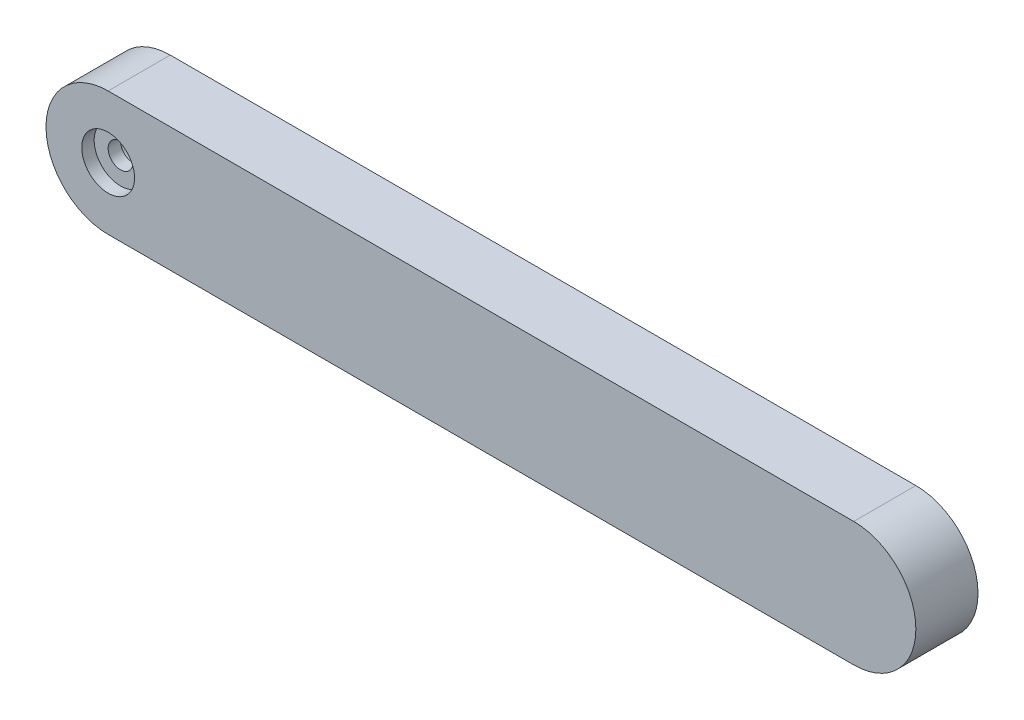
ISO-10303-21;
HEADER;
FILE_DESCRIPTION(('STEP AP214'),'2;1');
FILE_NAME('part.step','',(''),(''),'','','');
FILE_SCHEMA(('AUTOMOTIVE_DESIGN { 1 0 10303 214 1 1 1 1 }'));
ENDSEC;
DATA;
#1=APPLICATION_CONTEXT('core data for automotive mechanical design processes');
#2=APPLICATION_PROTOCOL_DEFINITION('international standard','automotive_design',2000,#1);
#3=PRODUCT_CONTEXT('',#1,'mechanical');
#4=PRODUCT('Part','Part','',(#3));
#5=PRODUCT_RELATED_PRODUCT_CATEGORY('part','',(#4));
#6=PRODUCT_DEFINITION_FORMATION('','',#4);
#7=PRODUCT_DEFINITION_CONTEXT('part definition',#1,'design');
#8=PRODUCT_DEFINITION('design','',#6,#7);
#9=PRODUCT_DEFINITION_SHAPE('','',#8);
#10=(LENGTH_UNIT() NAMED_UNIT(*) SI_UNIT(.MILLI.,.METRE.));
#11=(NAMED_UNIT(*) PLANE_ANGLE_UNIT() SI_UNIT($,.RADIAN.));
#12=(NAMED_UNIT(*) SI_UNIT($,.STERADIAN.) SOLID_ANGLE_UNIT());
#13=UNCERTAINTY_MEASURE_WITH_UNIT(LENGTH_MEASURE(1.E-05),#10,'distance_accuracy_value','');
#14=(GEOMETRIC_REPRESENTATION_CONTEXT(3) GLOBAL_UNCERTAINTY_ASSIGNED_CONTEXT((#13)) GLOBAL_UNIT_ASSIGNED_CONTEXT((#10,
#11,#12)) REPRESENTATION_CONTEXT('',''));
#15=CARTESIAN_POINT('',(0.,0.,0.));
#16=DIRECTION('',(0.,0.,1.));
#17=DIRECTION('',(1.,0.,0.));
#18=AXIS2_PLACEMENT_3D('',#15,#16,#17);
#19=CARTESIAN_POINT('',(0.,0.,5.));
#20=DIRECTION('',(0.,0.,-1.));
#21=DIRECTION('',(-1.,0.,0.));
#22=AXIS2_PLACEMENT_3D('',#19,#20,#21);
#23=CYLINDRICAL_SURFACE('',#22,5.);
#24=CARTESIAN_POINT('',(0.,0.,0.));
#25=DIRECTION('',(0.,0.,1.));
#26=DIRECTION('',(1.,0.,0.));
#27=AXIS2_PLACEMENT_3D('',#24,#25,#26);
#28=CIRCLE('',#27,5.);
#29=CARTESIAN_POINT('',(0.,5.,0.));
#30=VERTEX_POINT('',#29);
#31=CARTESIAN_POINT('',(0.,-5.,0.));
#32=VERTEX_POINT('',#31);
#33=EDGE_CURVE('E109',#30,#32,#28,.T.);
#34=ORIENTED_EDGE('',*,*,#33,.T.);
#35=DIRECTION('',(0.,0.,-1.));
#36=VECTOR('',#35,1.);
#37=CARTESIAN_POINT('',(0.,-5.,5.));
#38=LINE('',#37,#36);
#39=CARTESIAN_POINT('',(0.,-5.,5.));
#40=VERTEX_POINT('',#39);
#41=EDGE_CURVE('E11',#40,#32,#38,.T.);
#42=ORIENTED_EDGE('',*,*,#41,.F.);
#43=CARTESIAN_POINT('',(0.,0.,5.));
#44=DIRECTION('',(0.,0.,1.));
#45=DIRECTION('',(1.,0.,0.));
#46=AXIS2_PLACEMENT_3D('',#43,#44,#45);
#47=CIRCLE('',#46,5.);
#48=CARTESIAN_POINT('',(0.,5.,5.));
#49=VERTEX_POINT('',#48);
#50=EDGE_CURVE('E90',#49,#40,#47,.T.);
#51=ORIENTED_EDGE('',*,*,#50,.F.);
#52=DIRECTION('',(0.,0.,-1.));
#53=VECTOR('',#52,1.);
#54=CARTESIAN_POINT('',(0.,5.,5.));
#55=LINE('',#54,#53);
#56=EDGE_CURVE('E57',#49,#30,#55,.T.);
#57=ORIENTED_EDGE('',*,*,#56,.T.);
#58=EDGE_LOOP('',(#34,#42,#51,#57));
#59=FACE_BOUND('',#58,.T.);
#60=ADVANCED_FACE('F39',(#59),#23,.T.);
#61=CARTESIAN_POINT('',(0.,-5.,5.));
#62=DIRECTION('',(0.,1.,0.));
#63=DIRECTION('',(0.,0.,1.));
#64=AXIS2_PLACEMENT_3D('',#61,#62,#63);
#65=PLANE('',#64);
#66=DIRECTION('',(1.,0.,0.));
#67=VECTOR('',#66,1.);
#68=CARTESIAN_POINT('',(0.,-5.,0.));
#69=LINE('',#68,#67);
#70=CARTESIAN_POINT('',(60.,-5.,0.));
#71=VERTEX_POINT('',#70);
#72=EDGE_CURVE('E96',#32,#71,#69,.T.);
#73=ORIENTED_EDGE('',*,*,#72,.T.);
#74=DIRECTION('',(0.,0.,-1.));
#75=VECTOR('',#74,1.);
#76=CARTESIAN_POINT('',(60.,-5.,5.));
#77=LINE('',#76,#75);
#78=CARTESIAN_POINT('',(60.,-5.,5.));
#79=VERTEX_POINT('',#78);
#80=EDGE_CURVE('E49',#79,#71,#77,.T.);
#81=ORIENTED_EDGE('',*,*,#80,.F.);
#82=DIRECTION('',(1.,0.,0.));
#83=VECTOR('',#82,1.);
#84=CARTESIAN_POINT('',(0.,-5.,5.));
#85=LINE('',#84,#83);
#86=EDGE_CURVE('E83',#40,#79,#85,.T.);
#87=ORIENTED_EDGE('',*,*,#86,.F.);
#88=ORIENTED_EDGE('',*,*,#41,.T.);
#89=EDGE_LOOP('',(#73,#81,#87,#88));
#90=FACE_BOUND('',#89,.T.);
#91=ADVANCED_FACE('F95',(#90),#65,.F.);
#92=CARTESIAN_POINT('',(60.,0.,5.));
#93=DIRECTION('',(0.,0.,-1.));
#94=DIRECTION('',(-1.,0.,0.));
#95=AXIS2_PLACEMENT_3D('',#92,#93,#94);
#96=CYLINDRICAL_SURFACE('',#95,5.);
#97=CARTESIAN_POINT('',(60.,0.,0.));
#98=DIRECTION('',(0.,0.,1.));
#99=DIRECTION('',(1.,0.,0.));
#100=AXIS2_PLACEMENT_3D('',#97,#98,#99);
#101=CIRCLE('',#100,5.);
#102=CARTESIAN_POINT('',(60.,5.,0.));
#103=VERTEX_POINT('',#102);
#104=EDGE_CURVE('E115',#71,#103,#101,.T.);
#105=ORIENTED_EDGE('',*,*,#104,.T.);
#106=DIRECTION('',(0.,0.,-1.));
#107=VECTOR('',#106,1.);
#108=CARTESIAN_POINT('',(60.,5.,5.));
#109=LINE('',#108,#107);
#110=CARTESIAN_POINT('',(60.,5.,5.));
#111=VERTEX_POINT('',#110);
#112=EDGE_CURVE('E72',#111,#103,#109,.T.);
#113=ORIENTED_EDGE('',*,*,#112,.F.);
#114=CARTESIAN_POINT('',(60.,0.,5.));
#115=DIRECTION('',(0.,0.,1.));
#116=DIRECTION('',(1.,0.,0.));
#117=AXIS2_PLACEMENT_3D('',#114,#115,#116);
#118=CIRCLE('',#117,5.);
#119=EDGE_CURVE('E89',#79,#111,#118,.T.);
#120=ORIENTED_EDGE('',*,*,#119,.F.);
#121=ORIENTED_EDGE('',*,*,#80,.T.);
#122=EDGE_LOOP('',(#105,#113,#120,#121));
#123=FACE_BOUND('',#122,.T.);
#124=ADVANCED_FACE('F101',(#123),#96,.T.);
#125=CARTESIAN_POINT('',(0.,5.,5.));
#126=DIRECTION('',(0.,1.,0.));
#127=DIRECTION('',(0.,0.,1.));
#128=AXIS2_PLACEMENT_3D('',#125,#126,#127);
#129=PLANE('',#128);
#130=DIRECTION('',(1.,0.,0.));
#131=VECTOR('',#130,1.);
#132=CARTESIAN_POINT('',(0.,5.,0.));
#133=LINE('',#132,#131);
#134=EDGE_CURVE('E118',#30,#103,#133,.T.);
#135=ORIENTED_EDGE('',*,*,#134,.F.);
#136=ORIENTED_EDGE('',*,*,#56,.F.);
#137=DIRECTION('',(1.,0.,0.));
#138=VECTOR('',#137,1.);
#139=CARTESIAN_POINT('',(0.,5.,5.));
#140=LINE('',#139,#138);
#141=EDGE_CURVE('E103',#49,#111,#140,.T.);
#142=ORIENTED_EDGE('',*,*,#141,.T.);
#143=ORIENTED_EDGE('',*,*,#112,.T.);
#144=EDGE_LOOP('',(#135,#136,#142,#143));
#145=FACE_BOUND('',#144,.T.);
#146=ADVANCED_FACE('F170',(#145),#129,.T.);
#147=CARTESIAN_POINT('',(0.,0.,5.));
#148=DIRECTION('',(0.,0.,1.));
#149=DIRECTION('',(1.,0.,0.));
#150=AXIS2_PLACEMENT_3D('',#147,#148,#149);
#151=PLANE('',#150);
#152=CARTESIAN_POINT('',(0.,0.,5.));
#153=DIRECTION('',(0.,0.,1.));
#154=DIRECTION('',(1.,0.,0.));
#155=AXIS2_PLACEMENT_3D('',#152,#153,#154);
#156=CIRCLE('',#155,2.125);
#157=CARTESIAN_POINT('',(2.125,0.,5.));
#158=VERTEX_POINT('',#157);
#159=EDGE_CURVE('E136',#158,#158,#156,.T.);
#160=ORIENTED_EDGE('',*,*,#159,.F.);
#161=EDGE_LOOP('',(#160));
#162=FACE_BOUND('',#161,.T.);
#163=ORIENTED_EDGE('',*,*,#50,.T.);
#164=ORIENTED_EDGE('',*,*,#86,.T.);
#165=ORIENTED_EDGE('',*,*,#119,.T.);
#166=ORIENTED_EDGE('',*,*,#141,.F.);
#167=EDGE_LOOP('',(#163,#164,#165,#166));
#168=FACE_BOUND('',#167,.T.);
#169=ADVANCED_FACE('F86',(#162,#168),#151,.T.);
#170=CARTESIAN_POINT('',(0.,0.,0.));
#171=DIRECTION('',(0.,0.,1.));
#172=DIRECTION('',(1.,0.,0.));
#173=AXIS2_PLACEMENT_3D('',#170,#171,#172);
#174=PLANE('',#173);
#175=CARTESIAN_POINT('',(0.,0.,0.));
#176=DIRECTION('',(0.,0.,-1.));
#177=DIRECTION('',(-1.,0.,0.));
#178=AXIS2_PLACEMENT_3D('',#175,#176,#177);
#179=CIRCLE('',#178,2.0125);
#180=CARTESIAN_POINT('',(-2.0125,0.,0.));
#181=VERTEX_POINT('',#180);
#182=EDGE_CURVE('E128',#181,#181,#179,.T.);
#183=ORIENTED_EDGE('',*,*,#182,.F.);
#184=EDGE_LOOP('',(#183));
#185=FACE_BOUND('',#184,.T.);
#186=ORIENTED_EDGE('',*,*,#33,.F.);
#187=ORIENTED_EDGE('',*,*,#134,.T.);
#188=ORIENTED_EDGE('',*,*,#104,.F.);
#189=ORIENTED_EDGE('',*,*,#72,.F.);
#190=EDGE_LOOP('',(#186,#187,#188,#189));
#191=FACE_BOUND('',#190,.T.);
#192=ADVANCED_FACE('F164',(#185,#191),#174,.F.);
#193=CARTESIAN_POINT('',(0.,0.,3.));
#194=DIRECTION('',(0.,0.,-1.));
#195=DIRECTION('',(-1.,0.,0.));
#196=AXIS2_PLACEMENT_3D('',#193,#194,#195);
#197=CYLINDRICAL_SURFACE('',#196,2.0125);
#198=CARTESIAN_POINT('',(0.,0.,3.));
#199=DIRECTION('',(0.,0.,-1.));
#200=DIRECTION('',(-1.,0.,0.));
#201=AXIS2_PLACEMENT_3D('',#198,#199,#200);
#202=CIRCLE('',#201,2.0125);
#203=CARTESIAN_POINT('',(-2.0125,0.,3.));
#204=VERTEX_POINT('',#203);
#205=EDGE_CURVE('E112',#204,#204,#202,.T.);
#206=ORIENTED_EDGE('',*,*,#205,.F.);
#207=EDGE_LOOP('',(#206));
#208=FACE_BOUND('',#207,.T.);
#209=ORIENTED_EDGE('',*,*,#182,.T.);
#210=EDGE_LOOP('',(#209));
#211=FACE_BOUND('',#210,.T.);
#212=ADVANCED_FACE('F158',(#208,#211),#197,.F.);
#213=CARTESIAN_POINT('',(0.,0.,3.));
#214=DIRECTION('',(0.,0.,-1.));
#215=DIRECTION('',(-1.,0.,0.));
#216=AXIS2_PLACEMENT_3D('',#213,#214,#215);
#217=PLANE('',#216);
#218=CARTESIAN_POINT('',(0.,0.,3.));
#219=DIRECTION('',(0.,0.,-1.));
#220=DIRECTION('',(-1.,0.,0.));
#221=AXIS2_PLACEMENT_3D('',#218,#219,#220);
#222=CIRCLE('',#221,1.);
#223=CARTESIAN_POINT('',(-1.,0.,3.));
#224=VERTEX_POINT('',#223);
#225=EDGE_CURVE('E42',#224,#224,#222,.T.);
#226=ORIENTED_EDGE('',*,*,#225,.F.);
#227=EDGE_LOOP('',(#226));
#228=FACE_BOUND('',#227,.T.);
#229=ORIENTED_EDGE('',*,*,#205,.T.);
#230=EDGE_LOOP('',(#229));
#231=FACE_BOUND('',#230,.T.);
#232=ADVANCED_FACE('F154',(#228,#231),#217,.T.);
#233=CARTESIAN_POINT('',(0.,0.,4.));
#234=DIRECTION('',(0.,0.,1.));
#235=DIRECTION('',(1.,0.,0.));
#236=AXIS2_PLACEMENT_3D('',#233,#234,#235);
#237=CYLINDRICAL_SURFACE('',#236,2.125);
#238=CARTESIAN_POINT('',(0.,0.,4.));
#239=DIRECTION('',(0.,0.,1.));
#240=DIRECTION('',(1.,0.,0.));
#241=AXIS2_PLACEMENT_3D('',#238,#239,#240);
#242=CIRCLE('',#241,2.125);
#243=CARTESIAN_POINT('',(2.125,0.,4.));
#244=VERTEX_POINT('',#243);
#245=EDGE_CURVE('E132',#244,#244,#242,.T.);
#246=ORIENTED_EDGE('',*,*,#245,.F.);
#247=EDGE_LOOP('',(#246));
#248=FACE_BOUND('',#247,.T.);
#249=ORIENTED_EDGE('',*,*,#159,.T.);
#250=EDGE_LOOP('',(#249));
#251=FACE_BOUND('',#250,.T.);
#252=ADVANCED_FACE('F157',(#248,#251),#237,.F.);
#253=CARTESIAN_POINT('',(0.,0.,4.));
#254=DIRECTION('',(0.,0.,1.));
#255=DIRECTION('',(1.,0.,0.));
#256=AXIS2_PLACEMENT_3D('',#253,#254,#255);
#257=PLANE('',#256);
#258=CARTESIAN_POINT('',(0.,0.,4.));
#259=DIRECTION('',(0.,0.,1.));
#260=DIRECTION('',(1.,0.,0.));
#261=AXIS2_PLACEMENT_3D('',#258,#259,#260);
#262=CIRCLE('',#261,1.);
#263=CARTESIAN_POINT('',(1.,0.,4.));
#264=VERTEX_POINT('',#263);
#265=EDGE_CURVE('E143',#264,#264,#262,.T.);
#266=ORIENTED_EDGE('',*,*,#265,.F.);
#267=EDGE_LOOP('',(#266));
#268=FACE_BOUND('',#267,.T.);
#269=ORIENTED_EDGE('',*,*,#245,.T.);
#270=EDGE_LOOP('',(#269));
#271=FACE_BOUND('',#270,.T.);
#272=ADVANCED_FACE('F222',(#268,#271),#257,.T.);
#273=CARTESIAN_POINT('',(0.,0.,0.));
#274=DIRECTION('',(0.,0.,1.));
#275=DIRECTION('',(1.,0.,0.));
#276=AXIS2_PLACEMENT_3D('',#273,#274,#275);
#277=CYLINDRICAL_SURFACE('',#276,1.);
#278=ORIENTED_EDGE('',*,*,#225,.T.);
#279=EDGE_LOOP('',(#278));
#280=FACE_BOUND('',#279,.T.);
#281=ORIENTED_EDGE('',*,*,#265,.T.);
#282=EDGE_LOOP('',(#281));
#283=FACE_BOUND('',#282,.T.);
#284=ADVANCED_FACE('F152',(#280,#283),#277,.F.);
#285=CLOSED_SHELL('',(#60,#91,#124,#146,#169,#192,#212,#232,#252,#272,#284));
#286=MANIFOLD_SOLID_BREP('B2',#285);
#287=ADVANCED_BREP_SHAPE_REPRESENTATION('',(#18,#286),#14);
#288=SHAPE_DEFINITION_REPRESENTATION(#9,#287);
ENDSEC;
END-ISO-10303-21;
